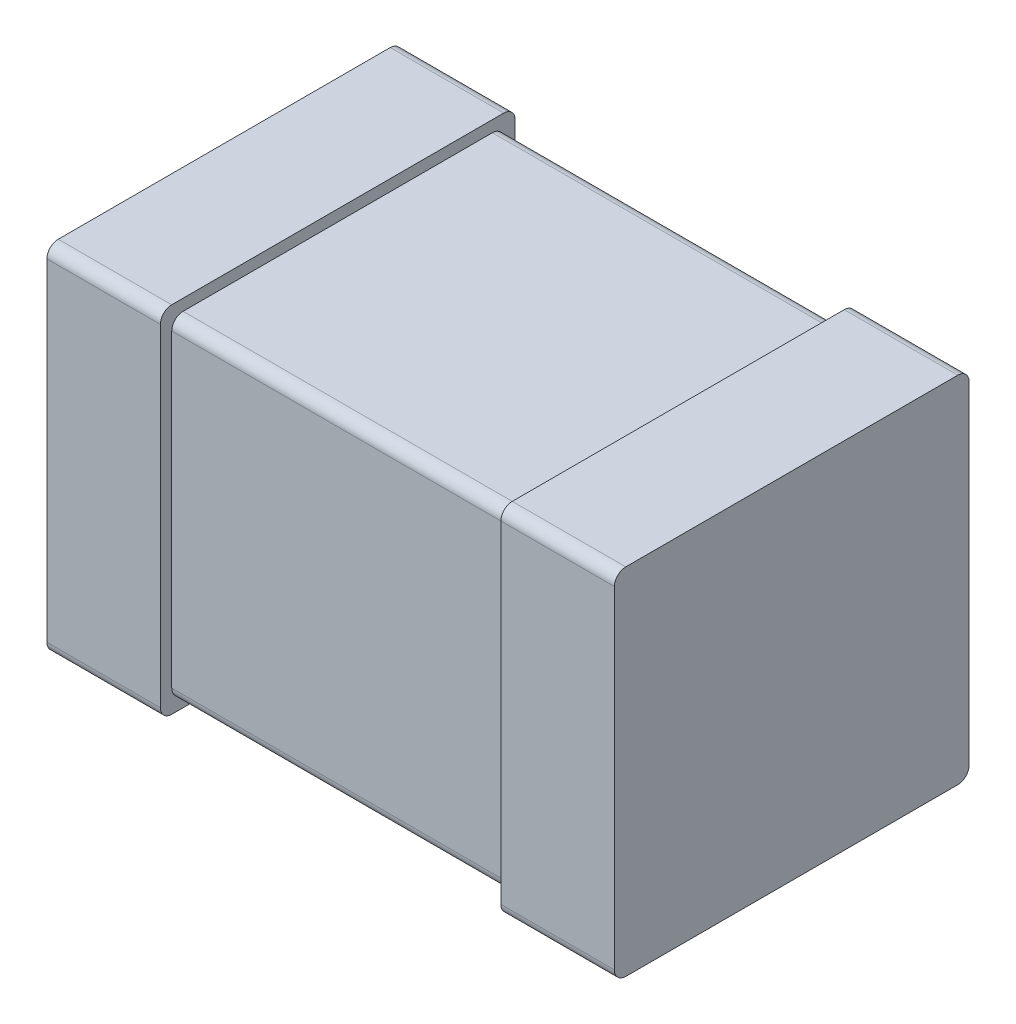
ISO-10303-21;
HEADER;
FILE_DESCRIPTION(('STEP AP214'),'2;1');
FILE_NAME('part.step','',(''),(''),'','','');
FILE_SCHEMA(('AUTOMOTIVE_DESIGN { 1 0 10303 214 1 1 1 1 }'));
ENDSEC;
DATA;
#1=APPLICATION_CONTEXT('core data for automotive mechanical design processes');
#2=APPLICATION_PROTOCOL_DEFINITION('international standard','automotive_design',2000,#1);
#3=PRODUCT_CONTEXT('',#1,'mechanical');
#4=PRODUCT('Part','Part','',(#3));
#5=PRODUCT_RELATED_PRODUCT_CATEGORY('part','',(#4));
#6=PRODUCT_DEFINITION_FORMATION('','',#4);
#7=PRODUCT_DEFINITION_CONTEXT('part definition',#1,'design');
#8=PRODUCT_DEFINITION('design','',#6,#7);
#9=PRODUCT_DEFINITION_SHAPE('','',#8);
#10=(LENGTH_UNIT() NAMED_UNIT(*) SI_UNIT(.MILLI.,.METRE.));
#11=(NAMED_UNIT(*) PLANE_ANGLE_UNIT() SI_UNIT($,.RADIAN.));
#12=(NAMED_UNIT(*) SI_UNIT($,.STERADIAN.) SOLID_ANGLE_UNIT());
#13=UNCERTAINTY_MEASURE_WITH_UNIT(LENGTH_MEASURE(1.E-05),#10,'distance_accuracy_value','');
#14=(GEOMETRIC_REPRESENTATION_CONTEXT(3) GLOBAL_UNCERTAINTY_ASSIGNED_CONTEXT((#13)) GLOBAL_UNIT_ASSIGNED_CONTEXT((#10,
#11,#12)) REPRESENTATION_CONTEXT('',''));
#15=CARTESIAN_POINT('',(0.,0.,0.));
#16=DIRECTION('',(0.,0.,1.));
#17=DIRECTION('',(1.,0.,0.));
#18=AXIS2_PLACEMENT_3D('',#15,#16,#17);
#19=CARTESIAN_POINT('',(0.6,-0.585,0.04));
#20=DIRECTION('',(1.,0.,0.));
#21=DIRECTION('',(0.,0.,-1.));
#22=AXIS2_PLACEMENT_3D('',#19,#20,#21);
#23=CYLINDRICAL_SURFACE('',#22,0.04);
#24=CARTESIAN_POINT('',(1.,-0.585,0.04));
#25=DIRECTION('',(1.,0.,0.));
#26=DIRECTION('',(0.,0.,-1.));
#27=AXIS2_PLACEMENT_3D('',#24,#25,#26);
#28=CIRCLE('',#27,0.04);
#29=CARTESIAN_POINT('',(1.,-0.625,0.04));
#30=VERTEX_POINT('',#29);
#31=CARTESIAN_POINT('',(1.,-0.585,0.));
#32=VERTEX_POINT('',#31);
#33=EDGE_CURVE('E272',#30,#32,#28,.T.);
#34=ORIENTED_EDGE('',*,*,#33,.F.);
#35=DIRECTION('',(1.,0.,0.));
#36=VECTOR('',#35,1.);
#37=CARTESIAN_POINT('',(0.6,-0.625,0.04));
#38=LINE('',#37,#36);
#39=CARTESIAN_POINT('',(0.6,-0.625,0.04));
#40=VERTEX_POINT('',#39);
#41=EDGE_CURVE('E161',#30,#40,#38,.F.);
#42=ORIENTED_EDGE('',*,*,#41,.T.);
#43=CARTESIAN_POINT('',(0.6,-0.585,0.04));
#44=DIRECTION('',(1.,0.,0.));
#45=DIRECTION('',(0.,0.,-1.));
#46=AXIS2_PLACEMENT_3D('',#43,#44,#45);
#47=CIRCLE('',#46,0.04);
#48=CARTESIAN_POINT('',(0.6,-0.585,0.));
#49=VERTEX_POINT('',#48);
#50=EDGE_CURVE('E20',#40,#49,#47,.T.);
#51=ORIENTED_EDGE('',*,*,#50,.T.);
#52=DIRECTION('',(1.,0.,0.));
#53=VECTOR('',#52,1.);
#54=CARTESIAN_POINT('',(0.6,-0.585,0.));
#55=LINE('',#54,#53);
#56=EDGE_CURVE('E159',#49,#32,#55,.T.);
#57=ORIENTED_EDGE('',*,*,#56,.T.);
#58=EDGE_LOOP('',(#34,#42,#51,#57));
#59=FACE_BOUND('',#58,.T.);
#60=ADVANCED_FACE('F17',(#59),#23,.T.);
#61=CARTESIAN_POINT('',(0.6,0.585,0.04));
#62=DIRECTION('',(1.,0.,0.));
#63=DIRECTION('',(0.,0.,-1.));
#64=AXIS2_PLACEMENT_3D('',#61,#62,#63);
#65=CYLINDRICAL_SURFACE('',#64,0.04);
#66=DIRECTION('',(1.,0.,0.));
#67=VECTOR('',#66,1.);
#68=CARTESIAN_POINT('',(0.6,0.585,0.));
#69=LINE('',#68,#67);
#70=CARTESIAN_POINT('',(1.,0.585,0.));
#71=VERTEX_POINT('',#70);
#72=CARTESIAN_POINT('',(0.6,0.585,0.));
#73=VERTEX_POINT('',#72);
#74=EDGE_CURVE('E215',#71,#73,#69,.F.);
#75=ORIENTED_EDGE('',*,*,#74,.T.);
#76=CARTESIAN_POINT('',(0.6,0.585,0.04));
#77=DIRECTION('',(1.,0.,0.));
#78=DIRECTION('',(0.,0.,-1.));
#79=AXIS2_PLACEMENT_3D('',#76,#77,#78);
#80=CIRCLE('',#79,0.04);
#81=CARTESIAN_POINT('',(0.6,0.625,0.04));
#82=VERTEX_POINT('',#81);
#83=EDGE_CURVE('E163',#73,#82,#80,.T.);
#84=ORIENTED_EDGE('',*,*,#83,.T.);
#85=DIRECTION('',(1.,0.,0.));
#86=VECTOR('',#85,1.);
#87=CARTESIAN_POINT('',(0.6,0.625,0.04));
#88=LINE('',#87,#86);
#89=CARTESIAN_POINT('',(1.,0.625,0.04));
#90=VERTEX_POINT('',#89);
#91=EDGE_CURVE('E209',#90,#82,#88,.F.);
#92=ORIENTED_EDGE('',*,*,#91,.F.);
#93=CARTESIAN_POINT('',(1.,0.585,0.04));
#94=DIRECTION('',(1.,0.,0.));
#95=DIRECTION('',(0.,0.,-1.));
#96=AXIS2_PLACEMENT_3D('',#93,#94,#95);
#97=CIRCLE('',#96,0.04);
#98=EDGE_CURVE('E270',#71,#90,#97,.T.);
#99=ORIENTED_EDGE('',*,*,#98,.F.);
#100=EDGE_LOOP('',(#75,#84,#92,#99));
#101=FACE_BOUND('',#100,.T.);
#102=ADVANCED_FACE('F277',(#101),#65,.T.);
#103=CARTESIAN_POINT('',(0.6,-0.585,1.21));
#104=DIRECTION('',(1.,0.,0.));
#105=DIRECTION('',(0.,0.,-1.));
#106=AXIS2_PLACEMENT_3D('',#103,#104,#105);
#107=CYLINDRICAL_SURFACE('',#106,0.04);
#108=DIRECTION('',(1.,0.,0.));
#109=VECTOR('',#108,1.);
#110=CARTESIAN_POINT('',(0.6,-0.585,1.25));
#111=LINE('',#110,#109);
#112=CARTESIAN_POINT('',(0.6,-0.585,1.25));
#113=VERTEX_POINT('',#112);
#114=CARTESIAN_POINT('',(1.,-0.585,1.25));
#115=VERTEX_POINT('',#114);
#116=EDGE_CURVE('E206',#113,#115,#111,.T.);
#117=ORIENTED_EDGE('',*,*,#116,.F.);
#118=CARTESIAN_POINT('',(0.6,-0.585,1.21));
#119=DIRECTION('',(1.,0.,0.));
#120=DIRECTION('',(0.,0.,-1.));
#121=AXIS2_PLACEMENT_3D('',#118,#119,#120);
#122=CIRCLE('',#121,0.04);
#123=CARTESIAN_POINT('',(0.6,-0.625,1.21));
#124=VERTEX_POINT('',#123);
#125=EDGE_CURVE('E274',#113,#124,#122,.T.);
#126=ORIENTED_EDGE('',*,*,#125,.T.);
#127=DIRECTION('',(1.,0.,0.));
#128=VECTOR('',#127,1.);
#129=CARTESIAN_POINT('',(0.6,-0.625,1.21));
#130=LINE('',#129,#128);
#131=CARTESIAN_POINT('',(1.,-0.625,1.21));
#132=VERTEX_POINT('',#131);
#133=EDGE_CURVE('E172',#124,#132,#130,.T.);
#134=ORIENTED_EDGE('',*,*,#133,.T.);
#135=CARTESIAN_POINT('',(1.,-0.585,1.21));
#136=DIRECTION('',(1.,0.,0.));
#137=DIRECTION('',(0.,0.,-1.));
#138=AXIS2_PLACEMENT_3D('',#135,#136,#137);
#139=CIRCLE('',#138,0.04);
#140=EDGE_CURVE('E268',#115,#132,#139,.T.);
#141=ORIENTED_EDGE('',*,*,#140,.F.);
#142=EDGE_LOOP('',(#117,#126,#134,#141));
#143=FACE_BOUND('',#142,.T.);
#144=ADVANCED_FACE('F297',(#143),#107,.T.);
#145=CARTESIAN_POINT('',(1.,-0.625,0.));
#146=DIRECTION('',(1.,0.,0.));
#147=DIRECTION('',(0.,0.,-1.));
#148=AXIS2_PLACEMENT_3D('',#145,#146,#147);
#149=PLANE('',#148);
#150=DIRECTION('',(0.,1.,0.));
#151=VECTOR('',#150,1.);
#152=CARTESIAN_POINT('',(1.,-0.625,1.25));
#153=LINE('',#152,#151);
#154=CARTESIAN_POINT('',(1.,0.585,1.25));
#155=VERTEX_POINT('',#154);
#156=EDGE_CURVE('E205',#115,#155,#153,.T.);
#157=ORIENTED_EDGE('',*,*,#156,.F.);
#158=ORIENTED_EDGE('',*,*,#140,.T.);
#159=DIRECTION('',(0.,0.,1.));
#160=VECTOR('',#159,1.);
#161=CARTESIAN_POINT('',(1.,-0.625,0.));
#162=LINE('',#161,#160);
#163=EDGE_CURVE('E220',#132,#30,#162,.F.);
#164=ORIENTED_EDGE('',*,*,#163,.T.);
#165=ORIENTED_EDGE('',*,*,#33,.T.);
#166=DIRECTION('',(0.,1.,0.));
#167=VECTOR('',#166,1.);
#168=CARTESIAN_POINT('',(1.,-0.625,0.));
#169=LINE('',#168,#167);
#170=EDGE_CURVE('E171',#32,#71,#169,.T.);
#171=ORIENTED_EDGE('',*,*,#170,.T.);
#172=ORIENTED_EDGE('',*,*,#98,.T.);
#173=DIRECTION('',(0.,0.,1.));
#174=VECTOR('',#173,1.);
#175=CARTESIAN_POINT('',(1.,0.625,0.));
#176=LINE('',#175,#174);
#177=CARTESIAN_POINT('',(1.,0.625,1.21));
#178=VERTEX_POINT('',#177);
#179=EDGE_CURVE('E212',#178,#90,#176,.F.);
#180=ORIENTED_EDGE('',*,*,#179,.F.);
#181=CARTESIAN_POINT('',(1.,0.585,1.21));
#182=DIRECTION('',(1.,0.,0.));
#183=DIRECTION('',(0.,0.,-1.));
#184=AXIS2_PLACEMENT_3D('',#181,#182,#183);
#185=CIRCLE('',#184,0.04);
#186=EDGE_CURVE('E227',#155,#178,#185,.F.);
#187=ORIENTED_EDGE('',*,*,#186,.F.);
#188=EDGE_LOOP('',(#157,#158,#164,#165,#171,#172,#180,#187));
#189=FACE_BOUND('',#188,.T.);
#190=ADVANCED_FACE('F289',(#189),#149,.T.);
#191=CARTESIAN_POINT('',(0.6,0.585,1.21));
#192=DIRECTION('',(1.,0.,0.));
#193=DIRECTION('',(0.,0.,-1.));
#194=AXIS2_PLACEMENT_3D('',#191,#192,#193);
#195=CYLINDRICAL_SURFACE('',#194,0.04);
#196=ORIENTED_EDGE('',*,*,#186,.T.);
#197=DIRECTION('',(1.,0.,0.));
#198=VECTOR('',#197,1.);
#199=CARTESIAN_POINT('',(0.6,0.625,1.21));
#200=LINE('',#199,#198);
#201=CARTESIAN_POINT('',(0.6,0.625,1.21));
#202=VERTEX_POINT('',#201);
#203=EDGE_CURVE('E208',#202,#178,#200,.T.);
#204=ORIENTED_EDGE('',*,*,#203,.F.);
#205=CARTESIAN_POINT('',(0.6,0.585,1.21));
#206=DIRECTION('',(1.,0.,0.));
#207=DIRECTION('',(0.,0.,-1.));
#208=AXIS2_PLACEMENT_3D('',#205,#206,#207);
#209=CIRCLE('',#208,0.04);
#210=CARTESIAN_POINT('',(0.6,0.585,1.25));
#211=VERTEX_POINT('',#210);
#212=EDGE_CURVE('E266',#202,#211,#209,.T.);
#213=ORIENTED_EDGE('',*,*,#212,.T.);
#214=DIRECTION('',(1.,0.,0.));
#215=VECTOR('',#214,1.);
#216=CARTESIAN_POINT('',(0.6,0.585,1.25));
#217=LINE('',#216,#215);
#218=EDGE_CURVE('E201',#155,#211,#217,.F.);
#219=ORIENTED_EDGE('',*,*,#218,.F.);
#220=EDGE_LOOP('',(#196,#204,#213,#219));
#221=FACE_BOUND('',#220,.T.);
#222=ADVANCED_FACE('F285',(#221),#195,.T.);
#223=CARTESIAN_POINT('',(0.6,-0.625,0.));
#224=DIRECTION('',(0.,1.,0.));
#225=DIRECTION('',(0.,0.,1.));
#226=AXIS2_PLACEMENT_3D('',#223,#224,#225);
#227=PLANE('',#226);
#228=DIRECTION('',(0.,0.,-1.));
#229=VECTOR('',#228,1.);
#230=CARTESIAN_POINT('',(0.6,-0.625,0.));
#231=LINE('',#230,#229);
#232=EDGE_CURVE('E179',#124,#40,#231,.T.);
#233=ORIENTED_EDGE('',*,*,#232,.T.);
#234=ORIENTED_EDGE('',*,*,#41,.F.);
#235=ORIENTED_EDGE('',*,*,#163,.F.);
#236=ORIENTED_EDGE('',*,*,#133,.F.);
#237=EDGE_LOOP('',(#233,#234,#235,#236));
#238=FACE_BOUND('',#237,.T.);
#239=ADVANCED_FACE('F292',(#238),#227,.F.);
#240=CARTESIAN_POINT('',(0.6,-0.625,0.));
#241=DIRECTION('',(0.,0.,1.));
#242=DIRECTION('',(1.,0.,0.));
#243=AXIS2_PLACEMENT_3D('',#240,#241,#242);
#244=PLANE('',#243);
#245=ORIENTED_EDGE('',*,*,#170,.F.);
#246=ORIENTED_EDGE('',*,*,#56,.F.);
#247=DIRECTION('',(0.,1.,0.));
#248=VECTOR('',#247,1.);
#249=CARTESIAN_POINT('',(0.6,-0.625,0.));
#250=LINE('',#249,#248);
#251=EDGE_CURVE('E169',#49,#73,#250,.T.);
#252=ORIENTED_EDGE('',*,*,#251,.T.);
#253=ORIENTED_EDGE('',*,*,#74,.F.);
#254=EDGE_LOOP('',(#245,#246,#252,#253));
#255=FACE_BOUND('',#254,.T.);
#256=ADVANCED_FACE('F167',(#255),#244,.F.);
#257=CARTESIAN_POINT('',(0.6,0.625,0.));
#258=DIRECTION('',(0.,1.,0.));
#259=DIRECTION('',(0.,0.,1.));
#260=AXIS2_PLACEMENT_3D('',#257,#258,#259);
#261=PLANE('',#260);
#262=DIRECTION('',(0.,0.,-1.));
#263=VECTOR('',#262,1.);
#264=CARTESIAN_POINT('',(0.6,0.625,0.));
#265=LINE('',#264,#263);
#266=EDGE_CURVE('E178',#82,#202,#265,.F.);
#267=ORIENTED_EDGE('',*,*,#266,.T.);
#268=ORIENTED_EDGE('',*,*,#203,.T.);
#269=ORIENTED_EDGE('',*,*,#179,.T.);
#270=ORIENTED_EDGE('',*,*,#91,.T.);
#271=EDGE_LOOP('',(#267,#268,#269,#270));
#272=FACE_BOUND('',#271,.T.);
#273=ADVANCED_FACE('F279',(#272),#261,.T.);
#274=CARTESIAN_POINT('',(0.6,-0.625,1.25));
#275=DIRECTION('',(0.,0.,1.));
#276=DIRECTION('',(1.,0.,0.));
#277=AXIS2_PLACEMENT_3D('',#274,#275,#276);
#278=PLANE('',#277);
#279=ORIENTED_EDGE('',*,*,#156,.T.);
#280=ORIENTED_EDGE('',*,*,#218,.T.);
#281=DIRECTION('',(0.,1.,0.));
#282=VECTOR('',#281,1.);
#283=CARTESIAN_POINT('',(0.6,-0.625,1.25));
#284=LINE('',#283,#282);
#285=EDGE_CURVE('E182',#211,#113,#284,.F.);
#286=ORIENTED_EDGE('',*,*,#285,.T.);
#287=ORIENTED_EDGE('',*,*,#116,.T.);
#288=EDGE_LOOP('',(#279,#280,#286,#287));
#289=FACE_BOUND('',#288,.T.);
#290=ADVANCED_FACE('F299',(#289),#278,.T.);
#291=CARTESIAN_POINT('',(-0.6,-0.545,1.17));
#292=DIRECTION('',(1.,0.,0.));
#293=DIRECTION('',(0.,0.,-1.));
#294=AXIS2_PLACEMENT_3D('',#291,#292,#293);
#295=CYLINDRICAL_SURFACE('',#294,0.04);
#296=DIRECTION('',(1.,0.,0.));
#297=VECTOR('',#296,1.);
#298=CARTESIAN_POINT('',(-0.6,-0.545,1.21));
#299=LINE('',#298,#297);
#300=CARTESIAN_POINT('',(-0.6,-0.545,1.21));
#301=VERTEX_POINT('',#300);
#302=CARTESIAN_POINT('',(0.6,-0.545,1.21));
#303=VERTEX_POINT('',#302);
#304=EDGE_CURVE('E195',#301,#303,#299,.T.);
#305=ORIENTED_EDGE('',*,*,#304,.F.);
#306=CARTESIAN_POINT('',(-0.6,-0.545,1.17));
#307=DIRECTION('',(1.,0.,0.));
#308=DIRECTION('',(0.,0.,-1.));
#309=AXIS2_PLACEMENT_3D('',#306,#307,#308);
#310=CIRCLE('',#309,0.04);
#311=CARTESIAN_POINT('',(-0.6,-0.585,1.17));
#312=VERTEX_POINT('',#311);
#313=EDGE_CURVE('E204',#301,#312,#310,.T.);
#314=ORIENTED_EDGE('',*,*,#313,.T.);
#315=DIRECTION('',(1.,0.,0.));
#316=VECTOR('',#315,1.);
#317=CARTESIAN_POINT('',(-0.6,-0.585,1.17));
#318=LINE('',#317,#316);
#319=CARTESIAN_POINT('',(0.6,-0.585,1.17));
#320=VERTEX_POINT('',#319);
#321=EDGE_CURVE('E305',#312,#320,#318,.T.);
#322=ORIENTED_EDGE('',*,*,#321,.T.);
#323=CARTESIAN_POINT('',(0.6,-0.545,1.17));
#324=DIRECTION('',(1.,0.,0.));
#325=DIRECTION('',(0.,0.,-1.));
#326=AXIS2_PLACEMENT_3D('',#323,#324,#325);
#327=CIRCLE('',#326,0.04);
#328=EDGE_CURVE('E256',#320,#303,#327,.F.);
#329=ORIENTED_EDGE('',*,*,#328,.T.);
#330=EDGE_LOOP('',(#305,#314,#322,#329));
#331=FACE_BOUND('',#330,.T.);
#332=ADVANCED_FACE('F478',(#331),#295,.T.);
#333=CARTESIAN_POINT('',(-0.6,0.545,1.17));
#334=DIRECTION('',(1.,0.,0.));
#335=DIRECTION('',(0.,0.,-1.));
#336=AXIS2_PLACEMENT_3D('',#333,#334,#335);
#337=CYLINDRICAL_SURFACE('',#336,0.04);
#338=CARTESIAN_POINT('',(0.6,0.545,1.17));
#339=DIRECTION('',(1.,0.,0.));
#340=DIRECTION('',(0.,0.,-1.));
#341=AXIS2_PLACEMENT_3D('',#338,#339,#340);
#342=CIRCLE('',#341,0.04);
#343=CARTESIAN_POINT('',(0.6,0.545,1.21));
#344=VERTEX_POINT('',#343);
#345=CARTESIAN_POINT('',(0.6,0.585,1.17));
#346=VERTEX_POINT('',#345);
#347=EDGE_CURVE('E254',#344,#346,#342,.F.);
#348=ORIENTED_EDGE('',*,*,#347,.T.);
#349=DIRECTION('',(1.,0.,0.));
#350=VECTOR('',#349,1.);
#351=CARTESIAN_POINT('',(-0.6,0.585,1.17));
#352=LINE('',#351,#350);
#353=CARTESIAN_POINT('',(-0.6,0.585,1.17));
#354=VERTEX_POINT('',#353);
#355=EDGE_CURVE('E315',#354,#346,#352,.T.);
#356=ORIENTED_EDGE('',*,*,#355,.F.);
#357=CARTESIAN_POINT('',(-0.6,0.545,1.17));
#358=DIRECTION('',(1.,0.,0.));
#359=DIRECTION('',(0.,0.,-1.));
#360=AXIS2_PLACEMENT_3D('',#357,#358,#359);
#361=CIRCLE('',#360,0.04);
#362=CARTESIAN_POINT('',(-0.6,0.545,1.21));
#363=VERTEX_POINT('',#362);
#364=EDGE_CURVE('E262',#354,#363,#361,.T.);
#365=ORIENTED_EDGE('',*,*,#364,.T.);
#366=DIRECTION('',(1.,0.,0.));
#367=VECTOR('',#366,1.);
#368=CARTESIAN_POINT('',(-0.6,0.545,1.21));
#369=LINE('',#368,#367);
#370=EDGE_CURVE('E191',#344,#363,#369,.F.);
#371=ORIENTED_EDGE('',*,*,#370,.F.);
#372=EDGE_LOOP('',(#348,#356,#365,#371));
#373=FACE_BOUND('',#372,.T.);
#374=ADVANCED_FACE('F474',(#373),#337,.T.);
#375=CARTESIAN_POINT('',(-0.6,-0.545,0.08));
#376=DIRECTION('',(1.,0.,0.));
#377=DIRECTION('',(0.,0.,-1.));
#378=AXIS2_PLACEMENT_3D('',#375,#376,#377);
#379=CYLINDRICAL_SURFACE('',#378,0.04);
#380=CARTESIAN_POINT('',(0.6,-0.545,0.08));
#381=DIRECTION('',(1.,0.,0.));
#382=DIRECTION('',(0.,0.,-1.));
#383=AXIS2_PLACEMENT_3D('',#380,#381,#382);
#384=CIRCLE('',#383,0.04);
#385=CARTESIAN_POINT('',(0.6,-0.545,0.04));
#386=VERTEX_POINT('',#385);
#387=CARTESIAN_POINT('',(0.6,-0.585,0.08));
#388=VERTEX_POINT('',#387);
#389=EDGE_CURVE('E259',#386,#388,#384,.F.);
#390=ORIENTED_EDGE('',*,*,#389,.T.);
#391=DIRECTION('',(1.,0.,0.));
#392=VECTOR('',#391,1.);
#393=CARTESIAN_POINT('',(-0.6,-0.585,0.08));
#394=LINE('',#393,#392);
#395=CARTESIAN_POINT('',(-0.6,-0.585,0.08));
#396=VERTEX_POINT('',#395);
#397=EDGE_CURVE('E199',#388,#396,#394,.F.);
#398=ORIENTED_EDGE('',*,*,#397,.T.);
#399=CARTESIAN_POINT('',(-0.6,-0.545,0.08));
#400=DIRECTION('',(1.,0.,0.));
#401=DIRECTION('',(0.,0.,-1.));
#402=AXIS2_PLACEMENT_3D('',#399,#400,#401);
#403=CIRCLE('',#402,0.04);
#404=CARTESIAN_POINT('',(-0.6,-0.545,0.04));
#405=VERTEX_POINT('',#404);
#406=EDGE_CURVE('E184',#396,#405,#403,.T.);
#407=ORIENTED_EDGE('',*,*,#406,.T.);
#408=DIRECTION('',(1.,0.,0.));
#409=VECTOR('',#408,1.);
#410=CARTESIAN_POINT('',(-0.6,-0.545,0.04));
#411=LINE('',#410,#409);
#412=EDGE_CURVE('E304',#405,#386,#411,.T.);
#413=ORIENTED_EDGE('',*,*,#412,.T.);
#414=EDGE_LOOP('',(#390,#398,#407,#413));
#415=FACE_BOUND('',#414,.T.);
#416=ADVANCED_FACE('F470',(#415),#379,.T.);
#417=CARTESIAN_POINT('',(0.6,-0.625,0.));
#418=DIRECTION('',(1.,0.,0.));
#419=DIRECTION('',(0.,0.,-1.));
#420=AXIS2_PLACEMENT_3D('',#417,#418,#419);
#421=PLANE('',#420);
#422=CARTESIAN_POINT('',(0.6,0.545,0.08));
#423=DIRECTION('',(1.,0.,0.));
#424=DIRECTION('',(0.,0.,-1.));
#425=AXIS2_PLACEMENT_3D('',#422,#423,#424);
#426=CIRCLE('',#425,0.04);
#427=CARTESIAN_POINT('',(0.6,0.585,0.08));
#428=VERTEX_POINT('',#427);
#429=CARTESIAN_POINT('',(0.6,0.545,0.04));
#430=VERTEX_POINT('',#429);
#431=EDGE_CURVE('E252',#428,#430,#426,.F.);
#432=ORIENTED_EDGE('',*,*,#431,.F.);
#433=DIRECTION('',(0.,0.,1.));
#434=VECTOR('',#433,1.);
#435=CARTESIAN_POINT('',(0.6,0.585,0.04));
#436=LINE('',#435,#434);
#437=EDGE_CURVE('E188',#346,#428,#436,.F.);
#438=ORIENTED_EDGE('',*,*,#437,.F.);
#439=ORIENTED_EDGE('',*,*,#347,.F.);
#440=DIRECTION('',(0.,1.,0.));
#441=VECTOR('',#440,1.);
#442=CARTESIAN_POINT('',(0.6,-0.585,1.21));
#443=LINE('',#442,#441);
#444=EDGE_CURVE('E192',#303,#344,#443,.T.);
#445=ORIENTED_EDGE('',*,*,#444,.F.);
#446=ORIENTED_EDGE('',*,*,#328,.F.);
#447=DIRECTION('',(0.,0.,1.));
#448=VECTOR('',#447,1.);
#449=CARTESIAN_POINT('',(0.6,-0.585,0.04));
#450=LINE('',#449,#448);
#451=EDGE_CURVE('E196',#320,#388,#450,.F.);
#452=ORIENTED_EDGE('',*,*,#451,.T.);
#453=ORIENTED_EDGE('',*,*,#389,.F.);
#454=DIRECTION('',(0.,1.,0.));
#455=VECTOR('',#454,1.);
#456=CARTESIAN_POINT('',(0.6,-0.585,0.04));
#457=LINE('',#456,#455);
#458=EDGE_CURVE('E301',#386,#430,#457,.T.);
#459=ORIENTED_EDGE('',*,*,#458,.T.);
#460=EDGE_LOOP('',(#432,#438,#439,#445,#446,#452,#453,#459));
#461=FACE_BOUND('',#460,.T.);
#462=ORIENTED_EDGE('',*,*,#285,.F.);
#463=ORIENTED_EDGE('',*,*,#212,.F.);
#464=ORIENTED_EDGE('',*,*,#266,.F.);
#465=ORIENTED_EDGE('',*,*,#83,.F.);
#466=ORIENTED_EDGE('',*,*,#251,.F.);
#467=ORIENTED_EDGE('',*,*,#50,.F.);
#468=ORIENTED_EDGE('',*,*,#232,.F.);
#469=ORIENTED_EDGE('',*,*,#125,.F.);
#470=EDGE_LOOP('',(#462,#463,#464,#465,#466,#467,#468,#469));
#471=FACE_BOUND('',#470,.T.);
#472=ADVANCED_FACE('F175',(#461,#471),#421,.F.);
#473=CARTESIAN_POINT('',(-0.6,0.545,0.08));
#474=DIRECTION('',(1.,0.,0.));
#475=DIRECTION('',(0.,0.,-1.));
#476=AXIS2_PLACEMENT_3D('',#473,#474,#475);
#477=CYLINDRICAL_SURFACE('',#476,0.04);
#478=DIRECTION('',(1.,0.,0.));
#479=VECTOR('',#478,1.);
#480=CARTESIAN_POINT('',(-0.6,0.545,0.04));
#481=LINE('',#480,#479);
#482=CARTESIAN_POINT('',(-0.6,0.545,0.04));
#483=VERTEX_POINT('',#482);
#484=EDGE_CURVE('E250',#430,#483,#481,.F.);
#485=ORIENTED_EDGE('',*,*,#484,.T.);
#486=CARTESIAN_POINT('',(-0.6,0.545,0.08));
#487=DIRECTION('',(1.,0.,0.));
#488=DIRECTION('',(0.,0.,-1.));
#489=AXIS2_PLACEMENT_3D('',#486,#487,#488);
#490=CIRCLE('',#489,0.04);
#491=CARTESIAN_POINT('',(-0.6,0.585,0.08));
#492=VERTEX_POINT('',#491);
#493=EDGE_CURVE('E200',#483,#492,#490,.T.);
#494=ORIENTED_EDGE('',*,*,#493,.T.);
#495=DIRECTION('',(1.,0.,0.));
#496=VECTOR('',#495,1.);
#497=CARTESIAN_POINT('',(-0.6,0.585,0.08));
#498=LINE('',#497,#496);
#499=EDGE_CURVE('E190',#428,#492,#498,.F.);
#500=ORIENTED_EDGE('',*,*,#499,.F.);
#501=ORIENTED_EDGE('',*,*,#431,.T.);
#502=EDGE_LOOP('',(#485,#494,#500,#501));
#503=FACE_BOUND('',#502,.T.);
#504=ADVANCED_FACE('F463',(#503),#477,.T.);
#505=CARTESIAN_POINT('',(-0.6,-0.585,0.04));
#506=DIRECTION('',(0.,1.,0.));
#507=DIRECTION('',(0.,0.,1.));
#508=AXIS2_PLACEMENT_3D('',#505,#506,#507);
#509=PLANE('',#508);
#510=DIRECTION('',(0.,0.,-1.));
#511=VECTOR('',#510,1.);
#512=CARTESIAN_POINT('',(-0.6,-0.585,0.));
#513=LINE('',#512,#511);
#514=EDGE_CURVE('E238',#396,#312,#513,.F.);
#515=ORIENTED_EDGE('',*,*,#514,.F.);
#516=ORIENTED_EDGE('',*,*,#397,.F.);
#517=ORIENTED_EDGE('',*,*,#451,.F.);
#518=ORIENTED_EDGE('',*,*,#321,.F.);
#519=EDGE_LOOP('',(#515,#516,#517,#518));
#520=FACE_BOUND('',#519,.T.);
#521=ADVANCED_FACE('F459',(#520),#509,.F.);
#522=CARTESIAN_POINT('',(-0.6,-0.585,1.21));
#523=DIRECTION('',(0.,0.,1.));
#524=DIRECTION('',(1.,0.,0.));
#525=AXIS2_PLACEMENT_3D('',#522,#523,#524);
#526=PLANE('',#525);
#527=ORIENTED_EDGE('',*,*,#444,.T.);
#528=ORIENTED_EDGE('',*,*,#370,.T.);
#529=DIRECTION('',(0.,1.,0.));
#530=VECTOR('',#529,1.);
#531=CARTESIAN_POINT('',(-0.6,-0.625,1.21));
#532=LINE('',#531,#530);
#533=EDGE_CURVE('E336',#301,#363,#532,.T.);
#534=ORIENTED_EDGE('',*,*,#533,.F.);
#535=ORIENTED_EDGE('',*,*,#304,.T.);
#536=EDGE_LOOP('',(#527,#528,#534,#535));
#537=FACE_BOUND('',#536,.T.);
#538=ADVANCED_FACE('F455',(#537),#526,.T.);
#539=CARTESIAN_POINT('',(-0.6,0.585,0.04));
#540=DIRECTION('',(0.,1.,0.));
#541=DIRECTION('',(0.,0.,1.));
#542=AXIS2_PLACEMENT_3D('',#539,#540,#541);
#543=PLANE('',#542);
#544=DIRECTION('',(0.,0.,-1.));
#545=VECTOR('',#544,1.);
#546=CARTESIAN_POINT('',(-0.6,0.585,0.));
#547=LINE('',#546,#545);
#548=EDGE_CURVE('E339',#354,#492,#547,.T.);
#549=ORIENTED_EDGE('',*,*,#548,.F.);
#550=ORIENTED_EDGE('',*,*,#355,.T.);
#551=ORIENTED_EDGE('',*,*,#437,.T.);
#552=ORIENTED_EDGE('',*,*,#499,.T.);
#553=EDGE_LOOP('',(#549,#550,#551,#552));
#554=FACE_BOUND('',#553,.T.);
#555=ADVANCED_FACE('F451',(#554),#543,.T.);
#556=CARTESIAN_POINT('',(-0.6,-0.585,0.04));
#557=DIRECTION('',(0.,0.,1.));
#558=DIRECTION('',(1.,0.,0.));
#559=AXIS2_PLACEMENT_3D('',#556,#557,#558);
#560=PLANE('',#559);
#561=ORIENTED_EDGE('',*,*,#458,.F.);
#562=ORIENTED_EDGE('',*,*,#412,.F.);
#563=DIRECTION('',(0.,1.,0.));
#564=VECTOR('',#563,1.);
#565=CARTESIAN_POINT('',(-0.6,-0.625,0.04));
#566=LINE('',#565,#564);
#567=EDGE_CURVE('E234',#483,#405,#566,.F.);
#568=ORIENTED_EDGE('',*,*,#567,.F.);
#569=ORIENTED_EDGE('',*,*,#484,.F.);
#570=EDGE_LOOP('',(#561,#562,#568,#569));
#571=FACE_BOUND('',#570,.T.);
#572=ADVANCED_FACE('F448',(#571),#560,.F.);
#573=CARTESIAN_POINT('',(-1.,-0.585,0.04));
#574=DIRECTION('',(1.,0.,0.));
#575=DIRECTION('',(0.,0.,-1.));
#576=AXIS2_PLACEMENT_3D('',#573,#574,#575);
#577=CYLINDRICAL_SURFACE('',#576,0.04);
#578=CARTESIAN_POINT('',(-0.6,-0.585,0.04));
#579=DIRECTION('',(1.,0.,0.));
#580=DIRECTION('',(0.,0.,-1.));
#581=AXIS2_PLACEMENT_3D('',#578,#579,#580);
#582=CIRCLE('',#581,0.04);
#583=CARTESIAN_POINT('',(-0.6,-0.625,0.04));
#584=VERTEX_POINT('',#583);
#585=CARTESIAN_POINT('',(-0.6,-0.585,0.));
#586=VERTEX_POINT('',#585);
#587=EDGE_CURVE('E242',#584,#586,#582,.T.);
#588=ORIENTED_EDGE('',*,*,#587,.F.);
#589=DIRECTION('',(1.,0.,0.));
#590=VECTOR('',#589,1.);
#591=CARTESIAN_POINT('',(-1.,-0.625,0.04));
#592=LINE('',#591,#590);
#593=CARTESIAN_POINT('',(-1.,-0.625,0.04));
#594=VERTEX_POINT('',#593);
#595=EDGE_CURVE('E324',#584,#594,#592,.F.);
#596=ORIENTED_EDGE('',*,*,#595,.T.);
#597=CARTESIAN_POINT('',(-1.,-0.585,0.04));
#598=DIRECTION('',(1.,0.,0.));
#599=DIRECTION('',(0.,0.,-1.));
#600=AXIS2_PLACEMENT_3D('',#597,#598,#599);
#601=CIRCLE('',#600,0.04);
#602=CARTESIAN_POINT('',(-1.,-0.585,0.));
#603=VERTEX_POINT('',#602);
#604=EDGE_CURVE('E248',#594,#603,#601,.T.);
#605=ORIENTED_EDGE('',*,*,#604,.T.);
#606=DIRECTION('',(1.,0.,0.));
#607=VECTOR('',#606,1.);
#608=CARTESIAN_POINT('',(-1.,-0.585,0.));
#609=LINE('',#608,#607);
#610=EDGE_CURVE('E329',#603,#586,#609,.T.);
#611=ORIENTED_EDGE('',*,*,#610,.T.);
#612=EDGE_LOOP('',(#588,#596,#605,#611));
#613=FACE_BOUND('',#612,.T.);
#614=ADVANCED_FACE('F413',(#613),#577,.T.);
#615=CARTESIAN_POINT('',(-1.,0.585,0.04));
#616=DIRECTION('',(1.,0.,0.));
#617=DIRECTION('',(0.,0.,-1.));
#618=AXIS2_PLACEMENT_3D('',#615,#616,#617);
#619=CYLINDRICAL_SURFACE('',#618,0.04);
#620=DIRECTION('',(1.,0.,0.));
#621=VECTOR('',#620,1.);
#622=CARTESIAN_POINT('',(-1.,0.585,0.));
#623=LINE('',#622,#621);
#624=CARTESIAN_POINT('',(-0.6,0.585,0.));
#625=VERTEX_POINT('',#624);
#626=CARTESIAN_POINT('',(-1.,0.585,0.));
#627=VERTEX_POINT('',#626);
#628=EDGE_CURVE('E328',#625,#627,#623,.F.);
#629=ORIENTED_EDGE('',*,*,#628,.T.);
#630=CARTESIAN_POINT('',(-1.,0.585,0.04));
#631=DIRECTION('',(1.,0.,0.));
#632=DIRECTION('',(0.,0.,-1.));
#633=AXIS2_PLACEMENT_3D('',#630,#631,#632);
#634=CIRCLE('',#633,0.04);
#635=CARTESIAN_POINT('',(-1.,0.625,0.04));
#636=VERTEX_POINT('',#635);
#637=EDGE_CURVE('E246',#627,#636,#634,.T.);
#638=ORIENTED_EDGE('',*,*,#637,.T.);
#639=DIRECTION('',(1.,0.,0.));
#640=VECTOR('',#639,1.);
#641=CARTESIAN_POINT('',(-1.,0.625,0.04));
#642=LINE('',#641,#640);
#643=CARTESIAN_POINT('',(-0.6,0.625,0.04));
#644=VERTEX_POINT('',#643);
#645=EDGE_CURVE('E333',#644,#636,#642,.F.);
#646=ORIENTED_EDGE('',*,*,#645,.F.);
#647=CARTESIAN_POINT('',(-0.6,0.585,0.04));
#648=DIRECTION('',(1.,0.,0.));
#649=DIRECTION('',(0.,0.,-1.));
#650=AXIS2_PLACEMENT_3D('',#647,#648,#649);
#651=CIRCLE('',#650,0.04);
#652=EDGE_CURVE('E239',#625,#644,#651,.T.);
#653=ORIENTED_EDGE('',*,*,#652,.F.);
#654=EDGE_LOOP('',(#629,#638,#646,#653));
#655=FACE_BOUND('',#654,.T.);
#656=ADVANCED_FACE('F442',(#655),#619,.T.);
#657=CARTESIAN_POINT('',(-1.,-0.585,1.21));
#658=DIRECTION('',(1.,0.,0.));
#659=DIRECTION('',(0.,0.,-1.));
#660=AXIS2_PLACEMENT_3D('',#657,#658,#659);
#661=CYLINDRICAL_SURFACE('',#660,0.04);
#662=DIRECTION('',(1.,0.,0.));
#663=VECTOR('',#662,1.);
#664=CARTESIAN_POINT('',(-1.,-0.585,1.25));
#665=LINE('',#664,#663);
#666=CARTESIAN_POINT('',(-1.,-0.585,1.25));
#667=VERTEX_POINT('',#666);
#668=CARTESIAN_POINT('',(-0.6,-0.585,1.25));
#669=VERTEX_POINT('',#668);
#670=EDGE_CURVE('E348',#667,#669,#665,.T.);
#671=ORIENTED_EDGE('',*,*,#670,.F.);
#672=CARTESIAN_POINT('',(-1.,-0.585,1.21));
#673=DIRECTION('',(1.,0.,0.));
#674=DIRECTION('',(0.,0.,-1.));
#675=AXIS2_PLACEMENT_3D('',#672,#673,#674);
#676=CIRCLE('',#675,0.04);
#677=CARTESIAN_POINT('',(-1.,-0.625,1.21));
#678=VERTEX_POINT('',#677);
#679=EDGE_CURVE('E35',#667,#678,#676,.T.);
#680=ORIENTED_EDGE('',*,*,#679,.T.);
#681=DIRECTION('',(1.,0.,0.));
#682=VECTOR('',#681,1.);
#683=CARTESIAN_POINT('',(-1.,-0.625,1.21));
#684=LINE('',#683,#682);
#685=CARTESIAN_POINT('',(-0.6,-0.625,1.21));
#686=VERTEX_POINT('',#685);
#687=EDGE_CURVE('E351',#678,#686,#684,.T.);
#688=ORIENTED_EDGE('',*,*,#687,.T.);
#689=CARTESIAN_POINT('',(-0.6,-0.585,1.21));
#690=DIRECTION('',(1.,0.,0.));
#691=DIRECTION('',(0.,0.,-1.));
#692=AXIS2_PLACEMENT_3D('',#689,#690,#691);
#693=CIRCLE('',#692,0.04);
#694=EDGE_CURVE('E235',#669,#686,#693,.T.);
#695=ORIENTED_EDGE('',*,*,#694,.F.);
#696=EDGE_LOOP('',(#671,#680,#688,#695));
#697=FACE_BOUND('',#696,.T.);
#698=ADVANCED_FACE('F419',(#697),#661,.T.);
#699=CARTESIAN_POINT('',(-0.6,-0.625,0.));
#700=DIRECTION('',(1.,0.,0.));
#701=DIRECTION('',(0.,0.,-1.));
#702=AXIS2_PLACEMENT_3D('',#699,#700,#701);
#703=PLANE('',#702);
#704=ORIENTED_EDGE('',*,*,#493,.F.);
#705=ORIENTED_EDGE('',*,*,#567,.T.);
#706=ORIENTED_EDGE('',*,*,#406,.F.);
#707=ORIENTED_EDGE('',*,*,#514,.T.);
#708=ORIENTED_EDGE('',*,*,#313,.F.);
#709=ORIENTED_EDGE('',*,*,#533,.T.);
#710=ORIENTED_EDGE('',*,*,#364,.F.);
#711=ORIENTED_EDGE('',*,*,#548,.T.);
#712=EDGE_LOOP('',(#704,#705,#706,#707,#708,#709,#710,#711));
#713=FACE_BOUND('',#712,.T.);
#714=DIRECTION('',(0.,1.,0.));
#715=VECTOR('',#714,1.);
#716=CARTESIAN_POINT('',(-0.6,-0.625,1.25));
#717=LINE('',#716,#715);
#718=CARTESIAN_POINT('',(-0.6,0.585,1.25));
#719=VERTEX_POINT('',#718);
#720=EDGE_CURVE('E344',#669,#719,#717,.T.);
#721=ORIENTED_EDGE('',*,*,#720,.F.);
#722=ORIENTED_EDGE('',*,*,#694,.T.);
#723=DIRECTION('',(0.,0.,1.));
#724=VECTOR('',#723,1.);
#725=CARTESIAN_POINT('',(-0.6,-0.625,0.));
#726=LINE('',#725,#724);
#727=EDGE_CURVE('E231',#686,#584,#726,.F.);
#728=ORIENTED_EDGE('',*,*,#727,.T.);
#729=ORIENTED_EDGE('',*,*,#587,.T.);
#730=DIRECTION('',(0.,1.,0.));
#731=VECTOR('',#730,1.);
#732=CARTESIAN_POINT('',(-0.6,-0.625,0.));
#733=LINE('',#732,#731);
#734=EDGE_CURVE('E325',#586,#625,#733,.T.);
#735=ORIENTED_EDGE('',*,*,#734,.T.);
#736=ORIENTED_EDGE('',*,*,#652,.T.);
#737=DIRECTION('',(0.,0.,1.));
#738=VECTOR('',#737,1.);
#739=CARTESIAN_POINT('',(-0.6,0.625,0.));
#740=LINE('',#739,#738);
#741=CARTESIAN_POINT('',(-0.6,0.625,1.21));
#742=VERTEX_POINT('',#741);
#743=EDGE_CURVE('E330',#742,#644,#740,.F.);
#744=ORIENTED_EDGE('',*,*,#743,.F.);
#745=CARTESIAN_POINT('',(-0.6,0.585,1.21));
#746=DIRECTION('',(1.,0.,0.));
#747=DIRECTION('',(0.,0.,-1.));
#748=AXIS2_PLACEMENT_3D('',#745,#746,#747);
#749=CIRCLE('',#748,0.04);
#750=EDGE_CURVE('E228',#719,#742,#749,.F.);
#751=ORIENTED_EDGE('',*,*,#750,.F.);
#752=EDGE_LOOP('',(#721,#722,#728,#729,#735,#736,#744,#751));
#753=FACE_BOUND('',#752,.T.);
#754=ADVANCED_FACE('F394',(#713,#753),#703,.T.);
#755=CARTESIAN_POINT('',(-1.,0.585,1.21));
#756=DIRECTION('',(1.,0.,0.));
#757=DIRECTION('',(0.,0.,-1.));
#758=AXIS2_PLACEMENT_3D('',#755,#756,#757);
#759=CYLINDRICAL_SURFACE('',#758,0.04);
#760=ORIENTED_EDGE('',*,*,#750,.T.);
#761=DIRECTION('',(1.,0.,0.));
#762=VECTOR('',#761,1.);
#763=CARTESIAN_POINT('',(-1.,0.625,1.21));
#764=LINE('',#763,#762);
#765=CARTESIAN_POINT('',(-1.,0.625,1.21));
#766=VERTEX_POINT('',#765);
#767=EDGE_CURVE('E358',#766,#742,#764,.T.);
#768=ORIENTED_EDGE('',*,*,#767,.F.);
#769=CARTESIAN_POINT('',(-1.,0.585,1.21));
#770=DIRECTION('',(1.,0.,0.));
#771=DIRECTION('',(0.,0.,-1.));
#772=AXIS2_PLACEMENT_3D('',#769,#770,#771);
#773=CIRCLE('',#772,0.04);
#774=CARTESIAN_POINT('',(-1.,0.585,1.25));
#775=VERTEX_POINT('',#774);
#776=EDGE_CURVE('E232',#766,#775,#773,.T.);
#777=ORIENTED_EDGE('',*,*,#776,.T.);
#778=DIRECTION('',(1.,0.,0.));
#779=VECTOR('',#778,1.);
#780=CARTESIAN_POINT('',(-1.,0.585,1.25));
#781=LINE('',#780,#779);
#782=EDGE_CURVE('E347',#719,#775,#781,.F.);
#783=ORIENTED_EDGE('',*,*,#782,.F.);
#784=EDGE_LOOP('',(#760,#768,#777,#783));
#785=FACE_BOUND('',#784,.T.);
#786=ADVANCED_FACE('F387',(#785),#759,.T.);
#787=CARTESIAN_POINT('',(-1.,-0.625,0.));
#788=DIRECTION('',(0.,1.,0.));
#789=DIRECTION('',(0.,0.,1.));
#790=AXIS2_PLACEMENT_3D('',#787,#788,#789);
#791=PLANE('',#790);
#792=DIRECTION('',(0.,0.,-1.));
#793=VECTOR('',#792,1.);
#794=CARTESIAN_POINT('',(-1.,-0.625,0.));
#795=LINE('',#794,#793);
#796=EDGE_CURVE('E367',#678,#594,#795,.T.);
#797=ORIENTED_EDGE('',*,*,#796,.T.);
#798=ORIENTED_EDGE('',*,*,#595,.F.);
#799=ORIENTED_EDGE('',*,*,#727,.F.);
#800=ORIENTED_EDGE('',*,*,#687,.F.);
#801=EDGE_LOOP('',(#797,#798,#799,#800));
#802=FACE_BOUND('',#801,.T.);
#803=ADVANCED_FACE('F416',(#802),#791,.F.);
#804=CARTESIAN_POINT('',(-1.,-0.625,0.));
#805=DIRECTION('',(0.,0.,1.));
#806=DIRECTION('',(1.,0.,0.));
#807=AXIS2_PLACEMENT_3D('',#804,#805,#806);
#808=PLANE('',#807);
#809=ORIENTED_EDGE('',*,*,#734,.F.);
#810=ORIENTED_EDGE('',*,*,#610,.F.);
#811=DIRECTION('',(0.,1.,0.));
#812=VECTOR('',#811,1.);
#813=CARTESIAN_POINT('',(-1.,-0.625,0.));
#814=LINE('',#813,#812);
#815=EDGE_CURVE('E370',#603,#627,#814,.T.);
#816=ORIENTED_EDGE('',*,*,#815,.T.);
#817=ORIENTED_EDGE('',*,*,#628,.F.);
#818=EDGE_LOOP('',(#809,#810,#816,#817));
#819=FACE_BOUND('',#818,.T.);
#820=ADVANCED_FACE('F412',(#819),#808,.F.);
#821=CARTESIAN_POINT('',(-1.,0.625,0.));
#822=DIRECTION('',(0.,1.,0.));
#823=DIRECTION('',(0.,0.,1.));
#824=AXIS2_PLACEMENT_3D('',#821,#822,#823);
#825=PLANE('',#824);
#826=DIRECTION('',(0.,0.,-1.));
#827=VECTOR('',#826,1.);
#828=CARTESIAN_POINT('',(-1.,0.625,0.));
#829=LINE('',#828,#827);
#830=EDGE_CURVE('E26',#636,#766,#829,.F.);
#831=ORIENTED_EDGE('',*,*,#830,.T.);
#832=ORIENTED_EDGE('',*,*,#767,.T.);
#833=ORIENTED_EDGE('',*,*,#743,.T.);
#834=ORIENTED_EDGE('',*,*,#645,.T.);
#835=EDGE_LOOP('',(#831,#832,#833,#834));
#836=FACE_BOUND('',#835,.T.);
#837=ADVANCED_FACE('F376',(#836),#825,.T.);
#838=CARTESIAN_POINT('',(-1.,-0.625,1.25));
#839=DIRECTION('',(0.,0.,1.));
#840=DIRECTION('',(1.,0.,0.));
#841=AXIS2_PLACEMENT_3D('',#838,#839,#840);
#842=PLANE('',#841);
#843=ORIENTED_EDGE('',*,*,#720,.T.);
#844=ORIENTED_EDGE('',*,*,#782,.T.);
#845=DIRECTION('',(0.,1.,0.));
#846=VECTOR('',#845,1.);
#847=CARTESIAN_POINT('',(-1.,-0.625,1.25));
#848=LINE('',#847,#846);
#849=EDGE_CURVE('E11',#775,#667,#848,.F.);
#850=ORIENTED_EDGE('',*,*,#849,.T.);
#851=ORIENTED_EDGE('',*,*,#670,.T.);
#852=EDGE_LOOP('',(#843,#844,#850,#851));
#853=FACE_BOUND('',#852,.T.);
#854=ADVANCED_FACE('F420',(#853),#842,.T.);
#855=CARTESIAN_POINT('',(-1.,-0.625,0.));
#856=DIRECTION('',(1.,0.,0.));
#857=DIRECTION('',(0.,0.,-1.));
#858=AXIS2_PLACEMENT_3D('',#855,#856,#857);
#859=PLANE('',#858);
#860=ORIENTED_EDGE('',*,*,#849,.F.);
#861=ORIENTED_EDGE('',*,*,#776,.F.);
#862=ORIENTED_EDGE('',*,*,#830,.F.);
#863=ORIENTED_EDGE('',*,*,#637,.F.);
#864=ORIENTED_EDGE('',*,*,#815,.F.);
#865=ORIENTED_EDGE('',*,*,#604,.F.);
#866=ORIENTED_EDGE('',*,*,#796,.F.);
#867=ORIENTED_EDGE('',*,*,#679,.F.);
#868=EDGE_LOOP('',(#860,#861,#862,#863,#864,#865,#866,#867));
#869=FACE_BOUND('',#868,.T.);
#870=ADVANCED_FACE('F383',(#869),#859,.F.);
#871=CLOSED_SHELL('',(#60,#102,#144,#190,#222,#239,#256,#273,#290,#332,#374,#416,#472,#504,#521,
#538,#555,#572,#614,#656,#698,#754,#786,#803,#820,#837,#854,#870));
#872=MANIFOLD_SOLID_BREP('B1',#871);
#873=ADVANCED_BREP_SHAPE_REPRESENTATION('',(#18,#872),#14);
#874=SHAPE_DEFINITION_REPRESENTATION(#9,#873);
ENDSEC;
END-ISO-10303-21;
